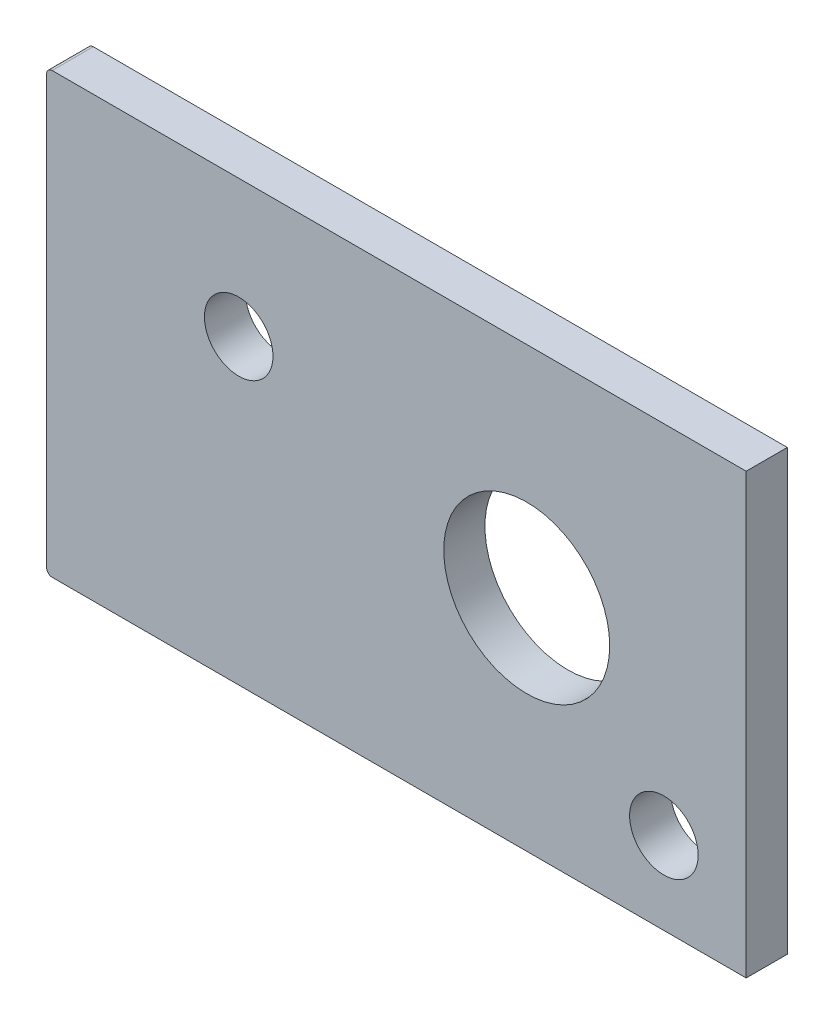
ISO-10303-21;
HEADER;
FILE_DESCRIPTION(('STEP AP214'),'2;1');
FILE_NAME('part.step','',(''),(''),'','','');
FILE_SCHEMA(('AUTOMOTIVE_DESIGN { 1 0 10303 214 1 1 1 1 }'));
ENDSEC;
DATA;
#1=APPLICATION_CONTEXT('core data for automotive mechanical design processes');
#2=APPLICATION_PROTOCOL_DEFINITION('international standard','automotive_design',2000,#1);
#3=PRODUCT_CONTEXT('',#1,'mechanical');
#4=PRODUCT('Part','Part','',(#3));
#5=PRODUCT_RELATED_PRODUCT_CATEGORY('part','',(#4));
#6=PRODUCT_DEFINITION_FORMATION('','',#4);
#7=PRODUCT_DEFINITION_CONTEXT('part definition',#1,'design');
#8=PRODUCT_DEFINITION('design','',#6,#7);
#9=PRODUCT_DEFINITION_SHAPE('','',#8);
#10=(LENGTH_UNIT() NAMED_UNIT(*) SI_UNIT(.MILLI.,.METRE.));
#11=(NAMED_UNIT(*) PLANE_ANGLE_UNIT() SI_UNIT($,.RADIAN.));
#12=(NAMED_UNIT(*) SI_UNIT($,.STERADIAN.) SOLID_ANGLE_UNIT());
#13=UNCERTAINTY_MEASURE_WITH_UNIT(LENGTH_MEASURE(1.E-05),#10,'distance_accuracy_value','');
#14=(GEOMETRIC_REPRESENTATION_CONTEXT(3) GLOBAL_UNCERTAINTY_ASSIGNED_CONTEXT((#13)) GLOBAL_UNIT_ASSIGNED_CONTEXT((#10,
#11,#12)) REPRESENTATION_CONTEXT('',''));
#15=CARTESIAN_POINT('',(0.,0.,0.));
#16=DIRECTION('',(0.,0.,1.));
#17=DIRECTION('',(1.,0.,0.));
#18=AXIS2_PLACEMENT_3D('',#15,#16,#17);
#19=CARTESIAN_POINT('',(0.,16.,-1.5));
#20=DIRECTION('',(1.,0.,0.));
#21=DIRECTION('',(0.,1.,0.));
#22=AXIS2_PLACEMENT_3D('',#19,#20,#21);
#23=PLANE('',#22);
#24=DIRECTION('',(0.,1.,0.));
#25=VECTOR('',#24,1.);
#26=CARTESIAN_POINT('',(0.,16.,0.));
#27=LINE('',#26,#25);
#28=CARTESIAN_POINT('',(0.,0.,0.));
#29=VERTEX_POINT('',#28);
#30=CARTESIAN_POINT('',(0.,16.,0.));
#31=VERTEX_POINT('',#30);
#32=EDGE_CURVE('E135',#29,#31,#27,.T.);
#33=ORIENTED_EDGE('',*,*,#32,.F.);
#34=DIRECTION('',(0.,0.,1.));
#35=VECTOR('',#34,1.);
#36=CARTESIAN_POINT('',(0.,0.,-1.5));
#37=LINE('',#36,#35);
#38=CARTESIAN_POINT('',(0.,0.,-1.5));
#39=VERTEX_POINT('',#38);
#40=EDGE_CURVE('E11',#39,#29,#37,.T.);
#41=ORIENTED_EDGE('',*,*,#40,.F.);
#42=DIRECTION('',(0.,1.,0.));
#43=VECTOR('',#42,1.);
#44=CARTESIAN_POINT('',(0.,16.,-1.5));
#45=LINE('',#44,#43);
#46=CARTESIAN_POINT('',(0.,16.,-1.5));
#47=VERTEX_POINT('',#46);
#48=EDGE_CURVE('E154',#39,#47,#45,.T.);
#49=ORIENTED_EDGE('',*,*,#48,.T.);
#50=DIRECTION('',(0.,0.,1.));
#51=VECTOR('',#50,1.);
#52=CARTESIAN_POINT('',(0.,16.,-1.5));
#53=LINE('',#52,#51);
#54=EDGE_CURVE('E45',#47,#31,#53,.T.);
#55=ORIENTED_EDGE('',*,*,#54,.T.);
#56=EDGE_LOOP('',(#33,#41,#49,#55));
#57=FACE_BOUND('',#56,.T.);
#58=ADVANCED_FACE('F42',(#57),#23,.T.);
#59=CARTESIAN_POINT('',(0.,0.,-1.5));
#60=DIRECTION('',(0.,-1.,0.));
#61=DIRECTION('',(1.,0.,0.));
#62=AXIS2_PLACEMENT_3D('',#59,#60,#61);
#63=PLANE('',#62);
#64=DIRECTION('',(1.,0.,0.));
#65=VECTOR('',#64,1.);
#66=CARTESIAN_POINT('',(0.,0.,0.));
#67=LINE('',#66,#65);
#68=CARTESIAN_POINT('',(-25.3,0.,0.));
#69=VERTEX_POINT('',#68);
#70=EDGE_CURVE('E151',#69,#29,#67,.T.);
#71=ORIENTED_EDGE('',*,*,#70,.F.);
#72=DIRECTION('',(0.,0.,1.));
#73=VECTOR('',#72,1.);
#74=CARTESIAN_POINT('',(-25.3,0.,-1.5));
#75=LINE('',#74,#73);
#76=CARTESIAN_POINT('',(-25.3,0.,-1.5));
#77=VERTEX_POINT('',#76);
#78=EDGE_CURVE('E52',#77,#69,#75,.T.);
#79=ORIENTED_EDGE('',*,*,#78,.F.);
#80=DIRECTION('',(1.,0.,0.));
#81=VECTOR('',#80,1.);
#82=CARTESIAN_POINT('',(0.,0.,-1.5));
#83=LINE('',#82,#81);
#84=EDGE_CURVE('E119',#77,#39,#83,.T.);
#85=ORIENTED_EDGE('',*,*,#84,.T.);
#86=ORIENTED_EDGE('',*,*,#40,.T.);
#87=EDGE_LOOP('',(#71,#79,#85,#86));
#88=FACE_BOUND('',#87,.T.);
#89=ADVANCED_FACE('F167',(#88),#63,.T.);
#90=CARTESIAN_POINT('',(-25.3,0.199999999999997,-1.5));
#91=DIRECTION('',(0.,0.,1.));
#92=DIRECTION('',(1.,0.,0.));
#93=AXIS2_PLACEMENT_3D('',#90,#91,#92);
#94=CYLINDRICAL_SURFACE('',#93,0.200000000000001);
#95=CARTESIAN_POINT('',(-25.3,0.199999999999997,0.));
#96=DIRECTION('',(0.,0.,1.));
#97=DIRECTION('',(-1.,0.,0.));
#98=AXIS2_PLACEMENT_3D('',#95,#96,#97);
#99=CIRCLE('',#98,0.200000000000001);
#100=CARTESIAN_POINT('',(-25.5,0.199999999999997,0.));
#101=VERTEX_POINT('',#100);
#102=EDGE_CURVE('E105',#101,#69,#99,.T.);
#103=ORIENTED_EDGE('',*,*,#102,.F.);
#104=DIRECTION('',(0.,0.,1.));
#105=VECTOR('',#104,1.);
#106=CARTESIAN_POINT('',(-25.5,0.199999999999997,-1.5));
#107=LINE('',#106,#105);
#108=CARTESIAN_POINT('',(-25.5,0.199999999999997,-1.5));
#109=VERTEX_POINT('',#108);
#110=EDGE_CURVE('E100',#109,#101,#107,.T.);
#111=ORIENTED_EDGE('',*,*,#110,.F.);
#112=CARTESIAN_POINT('',(-25.3,0.199999999999997,-1.5));
#113=DIRECTION('',(0.,0.,1.));
#114=DIRECTION('',(-1.,0.,0.));
#115=AXIS2_PLACEMENT_3D('',#112,#113,#114);
#116=CIRCLE('',#115,0.200000000000001);
#117=EDGE_CURVE('E103',#109,#77,#116,.T.);
#118=ORIENTED_EDGE('',*,*,#117,.T.);
#119=ORIENTED_EDGE('',*,*,#78,.T.);
#120=EDGE_LOOP('',(#103,#111,#118,#119));
#121=FACE_BOUND('',#120,.T.);
#122=ADVANCED_FACE('F102',(#121),#94,.T.);
#123=CARTESIAN_POINT('',(-25.5,15.8,-1.5));
#124=DIRECTION('',(-1.,0.,0.));
#125=DIRECTION('',(0.,0.,1.));
#126=AXIS2_PLACEMENT_3D('',#123,#124,#125);
#127=PLANE('',#126);
#128=DIRECTION('',(0.,-1.,0.));
#129=VECTOR('',#128,1.);
#130=CARTESIAN_POINT('',(-25.5,15.8,0.));
#131=LINE('',#130,#129);
#132=CARTESIAN_POINT('',(-25.5,15.8,0.));
#133=VERTEX_POINT('',#132);
#134=EDGE_CURVE('E146',#133,#101,#131,.T.);
#135=ORIENTED_EDGE('',*,*,#134,.F.);
#136=DIRECTION('',(0.,0.,1.));
#137=VECTOR('',#136,1.);
#138=CARTESIAN_POINT('',(-25.5,15.8,-1.5));
#139=LINE('',#138,#137);
#140=CARTESIAN_POINT('',(-25.5,15.8,-1.5));
#141=VERTEX_POINT('',#140);
#142=EDGE_CURVE('E111',#141,#133,#139,.T.);
#143=ORIENTED_EDGE('',*,*,#142,.F.);
#144=DIRECTION('',(0.,-1.,0.));
#145=VECTOR('',#144,1.);
#146=CARTESIAN_POINT('',(-25.5,15.8,-1.5));
#147=LINE('',#146,#145);
#148=EDGE_CURVE('E117',#141,#109,#147,.T.);
#149=ORIENTED_EDGE('',*,*,#148,.T.);
#150=ORIENTED_EDGE('',*,*,#110,.T.);
#151=EDGE_LOOP('',(#135,#143,#149,#150));
#152=FACE_BOUND('',#151,.T.);
#153=ADVANCED_FACE('F122',(#152),#127,.T.);
#154=CARTESIAN_POINT('',(-25.3,15.8,-1.5));
#155=DIRECTION('',(0.,0.,1.));
#156=DIRECTION('',(1.,0.,0.));
#157=AXIS2_PLACEMENT_3D('',#154,#155,#156);
#158=CYLINDRICAL_SURFACE('',#157,0.200000000000001);
#159=CARTESIAN_POINT('',(-25.3,15.8,0.));
#160=DIRECTION('',(0.,0.,1.));
#161=DIRECTION('',(1.,0.,0.));
#162=AXIS2_PLACEMENT_3D('',#159,#160,#161);
#163=CIRCLE('',#162,0.200000000000001);
#164=CARTESIAN_POINT('',(-25.3,16.,0.));
#165=VERTEX_POINT('',#164);
#166=EDGE_CURVE('E142',#165,#133,#163,.T.);
#167=ORIENTED_EDGE('',*,*,#166,.F.);
#168=DIRECTION('',(0.,0.,1.));
#169=VECTOR('',#168,1.);
#170=CARTESIAN_POINT('',(-25.3,16.,-1.5));
#171=LINE('',#170,#169);
#172=CARTESIAN_POINT('',(-25.3,16.,-1.5));
#173=VERTEX_POINT('',#172);
#174=EDGE_CURVE('E159',#173,#165,#171,.T.);
#175=ORIENTED_EDGE('',*,*,#174,.F.);
#176=CARTESIAN_POINT('',(-25.3,15.8,-1.5));
#177=DIRECTION('',(0.,0.,1.));
#178=DIRECTION('',(1.,0.,0.));
#179=AXIS2_PLACEMENT_3D('',#176,#177,#178);
#180=CIRCLE('',#179,0.200000000000001);
#181=EDGE_CURVE('E124',#173,#141,#180,.T.);
#182=ORIENTED_EDGE('',*,*,#181,.T.);
#183=ORIENTED_EDGE('',*,*,#142,.T.);
#184=EDGE_LOOP('',(#167,#175,#182,#183));
#185=FACE_BOUND('',#184,.T.);
#186=ADVANCED_FACE('F180',(#185),#158,.T.);
#187=CARTESIAN_POINT('',(0.,16.,-1.5));
#188=DIRECTION('',(0.,1.,0.));
#189=DIRECTION('',(0.,0.,1.));
#190=AXIS2_PLACEMENT_3D('',#187,#188,#189);
#191=PLANE('',#190);
#192=DIRECTION('',(-1.,0.,0.));
#193=VECTOR('',#192,1.);
#194=CARTESIAN_POINT('',(0.,16.,0.));
#195=LINE('',#194,#193);
#196=EDGE_CURVE('E138',#31,#165,#195,.T.);
#197=ORIENTED_EDGE('',*,*,#196,.F.);
#198=ORIENTED_EDGE('',*,*,#54,.F.);
#199=DIRECTION('',(-1.,0.,0.));
#200=VECTOR('',#199,1.);
#201=CARTESIAN_POINT('',(0.,16.,-1.5));
#202=LINE('',#201,#200);
#203=EDGE_CURVE('E129',#47,#173,#202,.T.);
#204=ORIENTED_EDGE('',*,*,#203,.T.);
#205=ORIENTED_EDGE('',*,*,#174,.T.);
#206=EDGE_LOOP('',(#197,#198,#204,#205));
#207=FACE_BOUND('',#206,.T.);
#208=ADVANCED_FACE('F164',(#207),#191,.T.);
#209=CARTESIAN_POINT('',(-25.3,0.199999999999997,-1.5));
#210=DIRECTION('',(0.,0.,-1.));
#211=DIRECTION('',(-1.,0.,0.));
#212=AXIS2_PLACEMENT_3D('',#209,#210,#211);
#213=PLANE('',#212);
#214=CARTESIAN_POINT('',(-8.,8.,-1.5));
#215=DIRECTION('',(0.,0.,1.));
#216=DIRECTION('',(1.,0.,0.));
#217=AXIS2_PLACEMENT_3D('',#214,#215,#216);
#218=CIRCLE('',#217,3.025);
#219=CARTESIAN_POINT('',(-4.975,8.,-1.5));
#220=VERTEX_POINT('',#219);
#221=EDGE_CURVE('E210',#220,#220,#218,.T.);
#222=ORIENTED_EDGE('',*,*,#221,.T.);
#223=EDGE_LOOP('',(#222));
#224=FACE_BOUND('',#223,.T.);
#225=CARTESIAN_POINT('',(-18.5,11.,-1.5));
#226=DIRECTION('',(0.,0.,1.));
#227=DIRECTION('',(1.,0.,0.));
#228=AXIS2_PLACEMENT_3D('',#225,#226,#227);
#229=CIRCLE('',#228,1.25);
#230=CARTESIAN_POINT('',(-17.25,11.,-1.5));
#231=VERTEX_POINT('',#230);
#232=EDGE_CURVE('E220',#231,#231,#229,.T.);
#233=ORIENTED_EDGE('',*,*,#232,.T.);
#234=EDGE_LOOP('',(#233));
#235=FACE_BOUND('',#234,.T.);
#236=CARTESIAN_POINT('',(-3.,3.,-1.5));
#237=DIRECTION('',(0.,0.,1.));
#238=DIRECTION('',(1.,0.,0.));
#239=AXIS2_PLACEMENT_3D('',#236,#237,#238);
#240=CIRCLE('',#239,1.25);
#241=CARTESIAN_POINT('',(-1.75,3.,-1.5));
#242=VERTEX_POINT('',#241);
#243=EDGE_CURVE('E139',#242,#242,#240,.T.);
#244=ORIENTED_EDGE('',*,*,#243,.T.);
#245=EDGE_LOOP('',(#244));
#246=FACE_BOUND('',#245,.T.);
#247=ORIENTED_EDGE('',*,*,#48,.F.);
#248=ORIENTED_EDGE('',*,*,#84,.F.);
#249=ORIENTED_EDGE('',*,*,#117,.F.);
#250=ORIENTED_EDGE('',*,*,#148,.F.);
#251=ORIENTED_EDGE('',*,*,#181,.F.);
#252=ORIENTED_EDGE('',*,*,#203,.F.);
#253=EDGE_LOOP('',(#247,#248,#249,#250,#251,#252));
#254=FACE_BOUND('',#253,.T.);
#255=ADVANCED_FACE('F115',(#224,#235,#246,#254),#213,.T.);
#256=CARTESIAN_POINT('',(-25.3,0.199999999999997,0.));
#257=DIRECTION('',(0.,0.,-1.));
#258=DIRECTION('',(-1.,0.,0.));
#259=AXIS2_PLACEMENT_3D('',#256,#257,#258);
#260=PLANE('',#259);
#261=CARTESIAN_POINT('',(-8.,8.,0.));
#262=DIRECTION('',(0.,0.,1.));
#263=DIRECTION('',(1.,0.,0.));
#264=AXIS2_PLACEMENT_3D('',#261,#262,#263);
#265=CIRCLE('',#264,3.025);
#266=CARTESIAN_POINT('',(-4.975,8.,0.));
#267=VERTEX_POINT('',#266);
#268=EDGE_CURVE('E213',#267,#267,#265,.T.);
#269=ORIENTED_EDGE('',*,*,#268,.F.);
#270=EDGE_LOOP('',(#269));
#271=FACE_BOUND('',#270,.T.);
#272=CARTESIAN_POINT('',(-18.5,11.,0.));
#273=DIRECTION('',(0.,0.,1.));
#274=DIRECTION('',(1.,0.,0.));
#275=AXIS2_PLACEMENT_3D('',#272,#273,#274);
#276=CIRCLE('',#275,1.25);
#277=CARTESIAN_POINT('',(-17.25,11.,0.));
#278=VERTEX_POINT('',#277);
#279=EDGE_CURVE('E217',#278,#278,#276,.T.);
#280=ORIENTED_EDGE('',*,*,#279,.F.);
#281=EDGE_LOOP('',(#280));
#282=FACE_BOUND('',#281,.T.);
#283=CARTESIAN_POINT('',(-3.,3.,0.));
#284=DIRECTION('',(0.,0.,1.));
#285=DIRECTION('',(1.,0.,0.));
#286=AXIS2_PLACEMENT_3D('',#283,#284,#285);
#287=CIRCLE('',#286,1.25);
#288=CARTESIAN_POINT('',(-1.75,3.,0.));
#289=VERTEX_POINT('',#288);
#290=EDGE_CURVE('E224',#289,#289,#287,.T.);
#291=ORIENTED_EDGE('',*,*,#290,.F.);
#292=EDGE_LOOP('',(#291));
#293=FACE_BOUND('',#292,.T.);
#294=ORIENTED_EDGE('',*,*,#32,.T.);
#295=ORIENTED_EDGE('',*,*,#196,.T.);
#296=ORIENTED_EDGE('',*,*,#166,.T.);
#297=ORIENTED_EDGE('',*,*,#134,.T.);
#298=ORIENTED_EDGE('',*,*,#102,.T.);
#299=ORIENTED_EDGE('',*,*,#70,.T.);
#300=EDGE_LOOP('',(#294,#295,#296,#297,#298,#299));
#301=FACE_BOUND('',#300,.T.);
#302=ADVANCED_FACE('F166',(#271,#282,#293,#301),#260,.F.);
#303=CARTESIAN_POINT('',(-3.,3.,-1.5));
#304=DIRECTION('',(0.,0.,1.));
#305=DIRECTION('',(1.,0.,0.));
#306=AXIS2_PLACEMENT_3D('',#303,#304,#305);
#307=CYLINDRICAL_SURFACE('',#306,1.25);
#308=ORIENTED_EDGE('',*,*,#243,.F.);
#309=EDGE_LOOP('',(#308));
#310=FACE_BOUND('',#309,.T.);
#311=ORIENTED_EDGE('',*,*,#290,.T.);
#312=EDGE_LOOP('',(#311));
#313=FACE_BOUND('',#312,.T.);
#314=ADVANCED_FACE('F191',(#310,#313),#307,.F.);
#315=CARTESIAN_POINT('',(-18.5,11.,-1.5));
#316=DIRECTION('',(0.,0.,1.));
#317=DIRECTION('',(1.,0.,0.));
#318=AXIS2_PLACEMENT_3D('',#315,#316,#317);
#319=CYLINDRICAL_SURFACE('',#318,1.25);
#320=ORIENTED_EDGE('',*,*,#232,.F.);
#321=EDGE_LOOP('',(#320));
#322=FACE_BOUND('',#321,.T.);
#323=ORIENTED_EDGE('',*,*,#279,.T.);
#324=EDGE_LOOP('',(#323));
#325=FACE_BOUND('',#324,.T.);
#326=ADVANCED_FACE('F198',(#322,#325),#319,.F.);
#327=CARTESIAN_POINT('',(-8.,8.,-1.5));
#328=DIRECTION('',(0.,0.,1.));
#329=DIRECTION('',(1.,0.,0.));
#330=AXIS2_PLACEMENT_3D('',#327,#328,#329);
#331=CYLINDRICAL_SURFACE('',#330,3.025);
#332=ORIENTED_EDGE('',*,*,#221,.F.);
#333=EDGE_LOOP('',(#332));
#334=FACE_BOUND('',#333,.T.);
#335=ORIENTED_EDGE('',*,*,#268,.T.);
#336=EDGE_LOOP('',(#335));
#337=FACE_BOUND('',#336,.T.);
#338=ADVANCED_FACE('F202',(#334,#337),#331,.F.);
#339=CLOSED_SHELL('',(#58,#89,#122,#153,#186,#208,#255,#302,#314,#326,#338));
#340=MANIFOLD_SOLID_BREP('B2',#339);
#341=ADVANCED_BREP_SHAPE_REPRESENTATION('',(#18,#340),#14);
#342=SHAPE_DEFINITION_REPRESENTATION(#9,#341);
ENDSEC;
END-ISO-10303-21;
